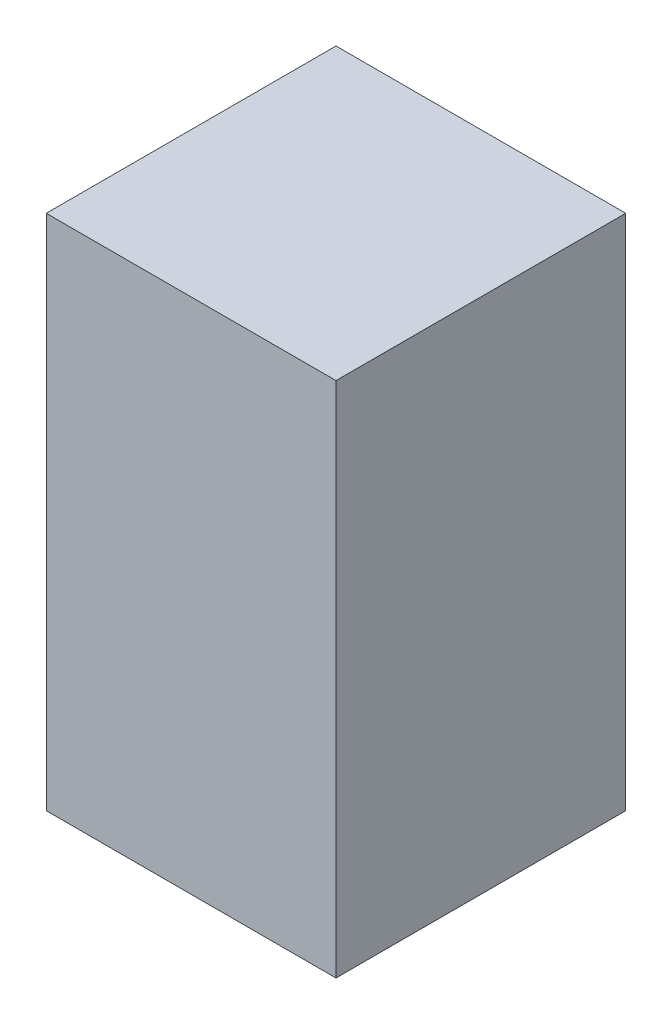
ISO-10303-21;
HEADER;
FILE_DESCRIPTION(('STEP AP214'),'2;1');
FILE_NAME('part.step','',(''),(''),'','','');
FILE_SCHEMA(('AUTOMOTIVE_DESIGN { 1 0 10303 214 1 1 1 1 }'));
ENDSEC;
DATA;
#1=APPLICATION_CONTEXT('core data for automotive mechanical design processes');
#2=APPLICATION_PROTOCOL_DEFINITION('international standard','automotive_design',2000,#1);
#3=PRODUCT_CONTEXT('',#1,'mechanical');
#4=PRODUCT('Part','Part','',(#3));
#5=PRODUCT_RELATED_PRODUCT_CATEGORY('part','',(#4));
#6=PRODUCT_DEFINITION_FORMATION('','',#4);
#7=PRODUCT_DEFINITION_CONTEXT('part definition',#1,'design');
#8=PRODUCT_DEFINITION('design','',#6,#7);
#9=PRODUCT_DEFINITION_SHAPE('','',#8);
#10=(LENGTH_UNIT() NAMED_UNIT(*) SI_UNIT(.MILLI.,.METRE.));
#11=(NAMED_UNIT(*) PLANE_ANGLE_UNIT() SI_UNIT($,.RADIAN.));
#12=(NAMED_UNIT(*) SI_UNIT($,.STERADIAN.) SOLID_ANGLE_UNIT());
#13=UNCERTAINTY_MEASURE_WITH_UNIT(LENGTH_MEASURE(1.E-05),#10,'distance_accuracy_value','');
#14=(GEOMETRIC_REPRESENTATION_CONTEXT(3) GLOBAL_UNCERTAINTY_ASSIGNED_CONTEXT((#13)) GLOBAL_UNIT_ASSIGNED_CONTEXT((#10,
#11,#12)) REPRESENTATION_CONTEXT('',''));
#15=CARTESIAN_POINT('',(0.,0.,0.));
#16=DIRECTION('',(0.,0.,1.));
#17=DIRECTION('',(1.,0.,0.));
#18=AXIS2_PLACEMENT_3D('',#15,#16,#17);
#19=CARTESIAN_POINT('',(14.,50.,0.));
#20=DIRECTION('',(0.,0.,-1.));
#21=DIRECTION('',(-1.,0.,0.));
#22=AXIS2_PLACEMENT_3D('',#19,#20,#21);
#23=PLANE('',#22);
#24=DIRECTION('',(0.,-1.,0.));
#25=VECTOR('',#24,1.);
#26=CARTESIAN_POINT('',(-14.,50.,0.));
#27=LINE('',#26,#25);
#28=CARTESIAN_POINT('',(-14.,50.,0.));
#29=VERTEX_POINT('',#28);
#30=CARTESIAN_POINT('',(-14.,0.,0.));
#31=VERTEX_POINT('',#30);
#32=EDGE_CURVE('E96',#29,#31,#27,.T.);
#33=ORIENTED_EDGE('',*,*,#32,.T.);
#34=DIRECTION('',(-1.,0.,0.));
#35=VECTOR('',#34,1.);
#36=CARTESIAN_POINT('',(14.,0.,0.));
#37=LINE('',#36,#35);
#38=CARTESIAN_POINT('',(14.,0.,0.));
#39=VERTEX_POINT('',#38);
#40=EDGE_CURVE('E11',#39,#31,#37,.T.);
#41=ORIENTED_EDGE('',*,*,#40,.F.);
#42=DIRECTION('',(0.,-1.,0.));
#43=VECTOR('',#42,1.);
#44=CARTESIAN_POINT('',(14.,50.,0.));
#45=LINE('',#44,#43);
#46=CARTESIAN_POINT('',(14.,50.,0.));
#47=VERTEX_POINT('',#46);
#48=EDGE_CURVE('E84',#47,#39,#45,.T.);
#49=ORIENTED_EDGE('',*,*,#48,.F.);
#50=DIRECTION('',(-1.,0.,0.));
#51=VECTOR('',#50,1.);
#52=CARTESIAN_POINT('',(14.,50.,0.));
#53=LINE('',#52,#51);
#54=EDGE_CURVE('E92',#47,#29,#53,.T.);
#55=ORIENTED_EDGE('',*,*,#54,.T.);
#56=EDGE_LOOP('',(#33,#41,#49,#55));
#57=FACE_BOUND('',#56,.T.);
#58=ADVANCED_FACE('F33',(#57),#23,.F.);
#59=CARTESIAN_POINT('',(14.,0.,0.));
#60=DIRECTION('',(0.,1.,0.));
#61=DIRECTION('',(0.,0.,1.));
#62=AXIS2_PLACEMENT_3D('',#59,#60,#61);
#63=PLANE('',#62);
#64=CARTESIAN_POINT('',(0.,0.,-14.));
#65=DIRECTION('',(0.,-1.,0.));
#66=DIRECTION('',(0.,0.,-1.));
#67=AXIS2_PLACEMENT_3D('',#64,#65,#66);
#68=CIRCLE('',#67,12.5);
#69=CARTESIAN_POINT('',(0.,0.,-26.5));
#70=VERTEX_POINT('',#69);
#71=EDGE_CURVE('E110',#70,#70,#68,.T.);
#72=ORIENTED_EDGE('',*,*,#71,.F.);
#73=EDGE_LOOP('',(#72));
#74=FACE_BOUND('',#73,.T.);
#75=DIRECTION('',(0.,0.,-1.));
#76=VECTOR('',#75,1.);
#77=CARTESIAN_POINT('',(-14.,0.,0.));
#78=LINE('',#77,#76);
#79=CARTESIAN_POINT('',(-14.,0.,-28.));
#80=VERTEX_POINT('',#79);
#81=EDGE_CURVE('E88',#31,#80,#78,.T.);
#82=ORIENTED_EDGE('',*,*,#81,.T.);
#83=DIRECTION('',(-1.,0.,0.));
#84=VECTOR('',#83,1.);
#85=CARTESIAN_POINT('',(14.,0.,-28.));
#86=LINE('',#85,#84);
#87=CARTESIAN_POINT('',(14.,0.,-28.));
#88=VERTEX_POINT('',#87);
#89=EDGE_CURVE('E41',#88,#80,#86,.T.);
#90=ORIENTED_EDGE('',*,*,#89,.F.);
#91=DIRECTION('',(0.,0.,-1.));
#92=VECTOR('',#91,1.);
#93=CARTESIAN_POINT('',(14.,0.,0.));
#94=LINE('',#93,#92);
#95=EDGE_CURVE('E79',#39,#88,#94,.T.);
#96=ORIENTED_EDGE('',*,*,#95,.F.);
#97=ORIENTED_EDGE('',*,*,#40,.T.);
#98=EDGE_LOOP('',(#82,#90,#96,#97));
#99=FACE_BOUND('',#98,.T.);
#100=ADVANCED_FACE('F87',(#74,#99),#63,.F.);
#101=CARTESIAN_POINT('',(14.,0.,-28.));
#102=DIRECTION('',(0.,0.,1.));
#103=DIRECTION('',(1.,0.,0.));
#104=AXIS2_PLACEMENT_3D('',#101,#102,#103);
#105=PLANE('',#104);
#106=DIRECTION('',(0.,1.,0.));
#107=VECTOR('',#106,1.);
#108=CARTESIAN_POINT('',(-14.,0.,-28.));
#109=LINE('',#108,#107);
#110=CARTESIAN_POINT('',(-14.,50.,-28.));
#111=VERTEX_POINT('',#110);
#112=EDGE_CURVE('E66',#80,#111,#109,.T.);
#113=ORIENTED_EDGE('',*,*,#112,.T.);
#114=DIRECTION('',(-1.,0.,0.));
#115=VECTOR('',#114,1.);
#116=CARTESIAN_POINT('',(14.,50.,-28.));
#117=LINE('',#116,#115);
#118=CARTESIAN_POINT('',(14.,50.,-28.));
#119=VERTEX_POINT('',#118);
#120=EDGE_CURVE('E89',#119,#111,#117,.T.);
#121=ORIENTED_EDGE('',*,*,#120,.F.);
#122=DIRECTION('',(0.,1.,0.));
#123=VECTOR('',#122,1.);
#124=CARTESIAN_POINT('',(14.,0.,-28.));
#125=LINE('',#124,#123);
#126=EDGE_CURVE('E82',#88,#119,#125,.T.);
#127=ORIENTED_EDGE('',*,*,#126,.F.);
#128=ORIENTED_EDGE('',*,*,#89,.T.);
#129=EDGE_LOOP('',(#113,#121,#127,#128));
#130=FACE_BOUND('',#129,.T.);
#131=ADVANCED_FACE('F90',(#130),#105,.F.);
#132=CARTESIAN_POINT('',(14.,50.,-28.));
#133=DIRECTION('',(0.,-1.,0.));
#134=DIRECTION('',(0.,0.,-1.));
#135=AXIS2_PLACEMENT_3D('',#132,#133,#134);
#136=PLANE('',#135);
#137=DIRECTION('',(0.,0.,1.));
#138=VECTOR('',#137,1.);
#139=CARTESIAN_POINT('',(-14.,50.,-28.));
#140=LINE('',#139,#138);
#141=EDGE_CURVE('E72',#111,#29,#140,.T.);
#142=ORIENTED_EDGE('',*,*,#141,.T.);
#143=ORIENTED_EDGE('',*,*,#54,.F.);
#144=DIRECTION('',(0.,0.,1.));
#145=VECTOR('',#144,1.);
#146=CARTESIAN_POINT('',(14.,50.,-28.));
#147=LINE('',#146,#145);
#148=EDGE_CURVE('E49',#119,#47,#147,.T.);
#149=ORIENTED_EDGE('',*,*,#148,.F.);
#150=ORIENTED_EDGE('',*,*,#120,.T.);
#151=EDGE_LOOP('',(#142,#143,#149,#150));
#152=FACE_BOUND('',#151,.T.);
#153=ADVANCED_FACE('F104',(#152),#136,.F.);
#154=CARTESIAN_POINT('',(14.,0.,0.));
#155=DIRECTION('',(1.,0.,0.));
#156=DIRECTION('',(0.,0.,-1.));
#157=AXIS2_PLACEMENT_3D('',#154,#155,#156);
#158=PLANE('',#157);
#159=ORIENTED_EDGE('',*,*,#48,.T.);
#160=ORIENTED_EDGE('',*,*,#95,.T.);
#161=ORIENTED_EDGE('',*,*,#126,.T.);
#162=ORIENTED_EDGE('',*,*,#148,.T.);
#163=EDGE_LOOP('',(#159,#160,#161,#162));
#164=FACE_BOUND('',#163,.T.);
#165=ADVANCED_FACE('F80',(#164),#158,.T.);
#166=CARTESIAN_POINT('',(-14.,0.,0.));
#167=DIRECTION('',(1.,0.,0.));
#168=DIRECTION('',(0.,0.,-1.));
#169=AXIS2_PLACEMENT_3D('',#166,#167,#168);
#170=PLANE('',#169);
#171=ORIENTED_EDGE('',*,*,#32,.F.);
#172=ORIENTED_EDGE('',*,*,#141,.F.);
#173=ORIENTED_EDGE('',*,*,#112,.F.);
#174=ORIENTED_EDGE('',*,*,#81,.F.);
#175=EDGE_LOOP('',(#171,#172,#173,#174));
#176=FACE_BOUND('',#175,.T.);
#177=ADVANCED_FACE('F107',(#176),#170,.F.);
#178=CARTESIAN_POINT('',(0.,40.,-14.));
#179=DIRECTION('',(0.,-1.,0.));
#180=DIRECTION('',(0.,0.,-1.));
#181=AXIS2_PLACEMENT_3D('',#178,#179,#180);
#182=CYLINDRICAL_SURFACE('',#181,12.5);
#183=CARTESIAN_POINT('',(0.,40.,-14.));
#184=DIRECTION('',(0.,-1.,0.));
#185=DIRECTION('',(0.,0.,-1.));
#186=AXIS2_PLACEMENT_3D('',#183,#184,#185);
#187=CIRCLE('',#186,12.5);
#188=CARTESIAN_POINT('',(0.,40.,-26.5));
#189=VERTEX_POINT('',#188);
#190=EDGE_CURVE('E99',#189,#189,#187,.T.);
#191=ORIENTED_EDGE('',*,*,#190,.F.);
#192=EDGE_LOOP('',(#191));
#193=FACE_BOUND('',#192,.T.);
#194=ORIENTED_EDGE('',*,*,#71,.T.);
#195=EDGE_LOOP('',(#194));
#196=FACE_BOUND('',#195,.T.);
#197=ADVANCED_FACE('F118',(#193,#196),#182,.F.);
#198=CARTESIAN_POINT('',(0.,40.,-14.));
#199=DIRECTION('',(0.,-1.,0.));
#200=DIRECTION('',(0.,0.,-1.));
#201=AXIS2_PLACEMENT_3D('',#198,#199,#200);
#202=PLANE('',#201);
#203=ORIENTED_EDGE('',*,*,#190,.T.);
#204=EDGE_LOOP('',(#203));
#205=FACE_BOUND('',#204,.T.);
#206=ADVANCED_FACE('F116',(#205),#202,.T.);
#207=CLOSED_SHELL('',(#58,#100,#131,#153,#165,#177,#197,#206));
#208=MANIFOLD_SOLID_BREP('B2',#207);
#209=ADVANCED_BREP_SHAPE_REPRESENTATION('',(#18,#208),#14);
#210=SHAPE_DEFINITION_REPRESENTATION(#9,#209);
ENDSEC;
END-ISO-10303-21;
